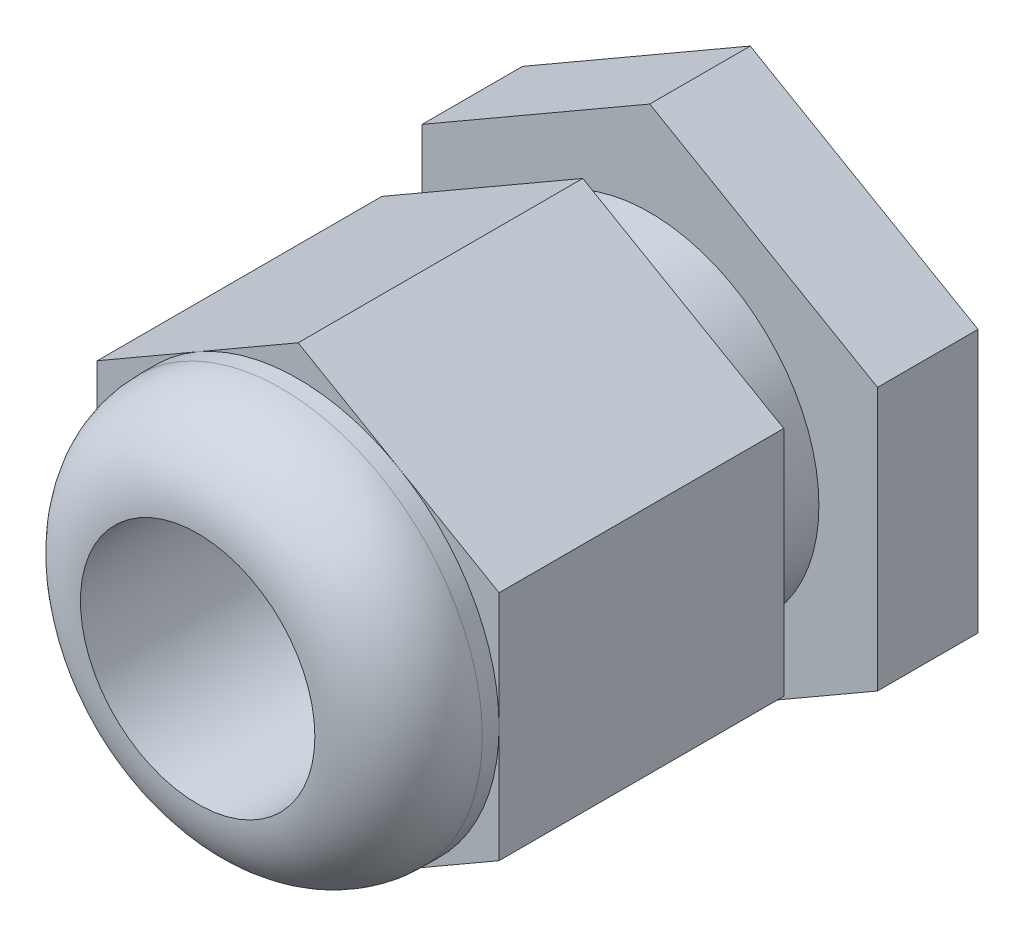
ISO-10303-21;
HEADER;
FILE_DESCRIPTION(('STEP AP214'),'2;1');
FILE_NAME('part.step','',(''),(''),'','','');
FILE_SCHEMA(('AUTOMOTIVE_DESIGN { 1 0 10303 214 1 1 1 1 }'));
ENDSEC;
DATA;
#1=APPLICATION_CONTEXT('core data for automotive mechanical design processes');
#2=APPLICATION_PROTOCOL_DEFINITION('international standard','automotive_design',2000,#1);
#3=PRODUCT_CONTEXT('',#1,'mechanical');
#4=PRODUCT('Part','Part','',(#3));
#5=PRODUCT_RELATED_PRODUCT_CATEGORY('part','',(#4));
#6=PRODUCT_DEFINITION_FORMATION('','',#4);
#7=PRODUCT_DEFINITION_CONTEXT('part definition',#1,'design');
#8=PRODUCT_DEFINITION('design','',#6,#7);
#9=PRODUCT_DEFINITION_SHAPE('','',#8);
#10=(LENGTH_UNIT() NAMED_UNIT(*) SI_UNIT(.MILLI.,.METRE.));
#11=(NAMED_UNIT(*) PLANE_ANGLE_UNIT() SI_UNIT($,.RADIAN.));
#12=(NAMED_UNIT(*) SI_UNIT($,.STERADIAN.) SOLID_ANGLE_UNIT());
#13=UNCERTAINTY_MEASURE_WITH_UNIT(LENGTH_MEASURE(1.E-05),#10,'distance_accuracy_value','');
#14=(GEOMETRIC_REPRESENTATION_CONTEXT(3) GLOBAL_UNCERTAINTY_ASSIGNED_CONTEXT((#13)) GLOBAL_UNIT_ASSIGNED_CONTEXT((#10,
#11,#12)) REPRESENTATION_CONTEXT('',''));
#15=CARTESIAN_POINT('',(0.,0.,0.));
#16=DIRECTION('',(0.,0.,1.));
#17=DIRECTION('',(1.,0.,0.));
#18=AXIS2_PLACEMENT_3D('',#15,#16,#17);
#19=CARTESIAN_POINT('',(0.,0.,-18.5));
#20=DIRECTION('',(0.,0.,-1.));
#21=DIRECTION('',(-1.,0.,0.));
#22=AXIS2_PLACEMENT_3D('',#19,#20,#21);
#23=PLANE('',#22);
#24=DIRECTION('',(0.866025403784439,0.5,0.));
#25=VECTOR('',#24,1.);
#26=CARTESIAN_POINT('',(-13.6,7.85196366097892,-18.5));
#27=LINE('',#26,#25);
#28=CARTESIAN_POINT('',(-13.6,7.85196366097892,-18.5));
#29=VERTEX_POINT('',#28);
#30=CARTESIAN_POINT('',(0.,15.7039273219578,-18.5));
#31=VERTEX_POINT('',#30);
#32=EDGE_CURVE('E184',#29,#31,#27,.T.);
#33=ORIENTED_EDGE('',*,*,#32,.T.);
#34=DIRECTION('',(0.866025403784439,-0.5,0.));
#35=VECTOR('',#34,1.);
#36=CARTESIAN_POINT('',(0.,15.7039273219578,-18.5));
#37=LINE('',#36,#35);
#38=CARTESIAN_POINT('',(13.6,7.85196366097892,-18.5));
#39=VERTEX_POINT('',#38);
#40=EDGE_CURVE('E145',#31,#39,#37,.T.);
#41=ORIENTED_EDGE('',*,*,#40,.T.);
#42=DIRECTION('',(0.,-1.,0.));
#43=VECTOR('',#42,1.);
#44=CARTESIAN_POINT('',(13.6,7.85196366097892,-18.5));
#45=LINE('',#44,#43);
#46=CARTESIAN_POINT('',(13.6,-7.85196366097891,-18.5));
#47=VERTEX_POINT('',#46);
#48=EDGE_CURVE('E188',#39,#47,#45,.T.);
#49=ORIENTED_EDGE('',*,*,#48,.T.);
#50=DIRECTION('',(-0.866025403784439,-0.5,0.));
#51=VECTOR('',#50,1.);
#52=CARTESIAN_POINT('',(13.6,-7.85196366097891,-18.5));
#53=LINE('',#52,#51);
#54=CARTESIAN_POINT('',(0.,-15.7039273219578,-18.5));
#55=VERTEX_POINT('',#54);
#56=EDGE_CURVE('E191',#47,#55,#53,.T.);
#57=ORIENTED_EDGE('',*,*,#56,.T.);
#58=DIRECTION('',(-0.866025403784439,0.5,0.));
#59=VECTOR('',#58,1.);
#60=CARTESIAN_POINT('',(0.,-15.7039273219578,-18.5));
#61=LINE('',#60,#59);
#62=CARTESIAN_POINT('',(-13.6,-7.85196366097891,-18.5));
#63=VERTEX_POINT('',#62);
#64=EDGE_CURVE('E170',#55,#63,#61,.T.);
#65=ORIENTED_EDGE('',*,*,#64,.T.);
#66=DIRECTION('',(0.,1.,0.));
#67=VECTOR('',#66,1.);
#68=CARTESIAN_POINT('',(-13.6,-7.85196366097891,-18.5));
#69=LINE('',#68,#67);
#70=EDGE_CURVE('E167',#63,#29,#69,.T.);
#71=ORIENTED_EDGE('',*,*,#70,.T.);
#72=EDGE_LOOP('',(#33,#41,#49,#57,#65,#71));
#73=FACE_BOUND('',#72,.T.);
#74=CARTESIAN_POINT('',(0.,0.,-18.5));
#75=DIRECTION('',(0.,0.,-1.));
#76=DIRECTION('',(-1.,0.,0.));
#77=AXIS2_PLACEMENT_3D('',#74,#75,#76);
#78=CIRCLE('',#77,10.1);
#79=CARTESIAN_POINT('',(-10.1,0.,-18.5));
#80=VERTEX_POINT('',#79);
#81=EDGE_CURVE('E173',#80,#80,#78,.T.);
#82=ORIENTED_EDGE('',*,*,#81,.F.);
#83=EDGE_LOOP('',(#82));
#84=FACE_BOUND('',#83,.T.);
#85=ADVANCED_FACE('F32',(#73,#84),#23,.T.);
#86=CARTESIAN_POINT('',(0.,0.,-18.5));
#87=DIRECTION('',(0.,0.,1.));
#88=DIRECTION('',(1.,0.,0.));
#89=AXIS2_PLACEMENT_3D('',#86,#87,#88);
#90=CYLINDRICAL_SURFACE('',#89,10.1);
#91=CARTESIAN_POINT('',(0.,0.,-8.5));
#92=DIRECTION('',(0.,0.,1.));
#93=DIRECTION('',(1.,0.,0.));
#94=AXIS2_PLACEMENT_3D('',#91,#92,#93);
#95=CIRCLE('',#94,10.1);
#96=CARTESIAN_POINT('',(10.1,0.,-8.5));
#97=VERTEX_POINT('',#96);
#98=EDGE_CURVE('E40',#97,#97,#95,.F.);
#99=ORIENTED_EDGE('',*,*,#98,.T.);
#100=EDGE_LOOP('',(#99));
#101=FACE_BOUND('',#100,.T.);
#102=CARTESIAN_POINT('',(0.,0.,-12.5));
#103=DIRECTION('',(0.,0.,-1.));
#104=DIRECTION('',(-1.,0.,0.));
#105=AXIS2_PLACEMENT_3D('',#102,#103,#104);
#106=CIRCLE('',#105,10.1);
#107=CARTESIAN_POINT('',(-10.1,0.,-12.5));
#108=VERTEX_POINT('',#107);
#109=EDGE_CURVE('E11',#108,#108,#106,.T.);
#110=ORIENTED_EDGE('',*,*,#109,.F.);
#111=EDGE_LOOP('',(#110));
#112=FACE_BOUND('',#111,.T.);
#113=ADVANCED_FACE('F266',(#101,#112),#90,.T.);
#114=CARTESIAN_POINT('',(0.,0.,-8.5));
#115=DIRECTION('',(0.,0.,1.));
#116=DIRECTION('',(1.,0.,0.));
#117=AXIS2_PLACEMENT_3D('',#114,#115,#116);
#118=PLANE('',#117);
#119=DIRECTION('',(-0.866025403784439,0.5,0.));
#120=VECTOR('',#119,1.);
#121=CARTESIAN_POINT('',(12.,6.92820323027552,-8.5));
#122=LINE('',#121,#120);
#123=CARTESIAN_POINT('',(12.,6.92820323027552,-8.5));
#124=VERTEX_POINT('',#123);
#125=CARTESIAN_POINT('',(0.,13.856406460551,-8.5));
#126=VERTEX_POINT('',#125);
#127=EDGE_CURVE('E207',#124,#126,#122,.T.);
#128=ORIENTED_EDGE('',*,*,#127,.F.);
#129=DIRECTION('',(0.,1.,0.));
#130=VECTOR('',#129,1.);
#131=CARTESIAN_POINT('',(12.,-6.92820323027551,-8.5));
#132=LINE('',#131,#130);
#133=CARTESIAN_POINT('',(12.,-6.92820323027551,-8.5));
#134=VERTEX_POINT('',#133);
#135=EDGE_CURVE('E242',#134,#124,#132,.T.);
#136=ORIENTED_EDGE('',*,*,#135,.F.);
#137=DIRECTION('',(0.866025403784439,0.5,0.));
#138=VECTOR('',#137,1.);
#139=CARTESIAN_POINT('',(0.,-13.856406460551,-8.5));
#140=LINE('',#139,#138);
#141=CARTESIAN_POINT('',(0.,-13.856406460551,-8.5));
#142=VERTEX_POINT('',#141);
#143=EDGE_CURVE('E240',#142,#134,#140,.T.);
#144=ORIENTED_EDGE('',*,*,#143,.F.);
#145=DIRECTION('',(0.866025403784438,-0.5,0.));
#146=VECTOR('',#145,1.);
#147=CARTESIAN_POINT('',(-12.,-6.92820323027551,-8.5));
#148=LINE('',#147,#146);
#149=CARTESIAN_POINT('',(-12.,-6.92820323027551,-8.5));
#150=VERTEX_POINT('',#149);
#151=EDGE_CURVE('E238',#150,#142,#148,.T.);
#152=ORIENTED_EDGE('',*,*,#151,.F.);
#153=DIRECTION('',(0.,-1.,0.));
#154=VECTOR('',#153,1.);
#155=CARTESIAN_POINT('',(-12.,6.92820323027551,-8.5));
#156=LINE('',#155,#154);
#157=CARTESIAN_POINT('',(-12.,6.92820323027551,-8.5));
#158=VERTEX_POINT('',#157);
#159=EDGE_CURVE('E236',#158,#150,#156,.T.);
#160=ORIENTED_EDGE('',*,*,#159,.F.);
#161=DIRECTION('',(-0.866025403784439,-0.5,0.));
#162=VECTOR('',#161,1.);
#163=CARTESIAN_POINT('',(0.,13.856406460551,-8.5));
#164=LINE('',#163,#162);
#165=EDGE_CURVE('E234',#126,#158,#164,.T.);
#166=ORIENTED_EDGE('',*,*,#165,.F.);
#167=EDGE_LOOP('',(#128,#136,#144,#152,#160,#166));
#168=FACE_BOUND('',#167,.T.);
#169=ORIENTED_EDGE('',*,*,#98,.F.);
#170=EDGE_LOOP('',(#169));
#171=FACE_BOUND('',#170,.T.);
#172=ADVANCED_FACE('F269',(#168,#171),#118,.F.);
#173=CARTESIAN_POINT('',(0.,0.,8.5));
#174=DIRECTION('',(0.,0.,1.));
#175=DIRECTION('',(1.,0.,0.));
#176=AXIS2_PLACEMENT_3D('',#173,#174,#175);
#177=PLANE('',#176);
#178=CARTESIAN_POINT('',(0.,0.,8.5));
#179=DIRECTION('',(0.,0.,1.));
#180=DIRECTION('',(1.,0.,0.));
#181=AXIS2_PLACEMENT_3D('',#178,#179,#180);
#182=CIRCLE('',#181,12.);
#183=CARTESIAN_POINT('',(12.,0.,8.5));
#184=VERTEX_POINT('',#183);
#185=CARTESIAN_POINT('',(6.,10.3923048454133,8.5));
#186=VERTEX_POINT('',#185);
#187=EDGE_CURVE('E197',#184,#186,#182,.T.);
#188=ORIENTED_EDGE('',*,*,#187,.F.);
#189=DIRECTION('',(0.,1.,0.));
#190=VECTOR('',#189,1.);
#191=CARTESIAN_POINT('',(12.,-6.92820323027551,8.5));
#192=LINE('',#191,#190);
#193=CARTESIAN_POINT('',(12.,6.92820323027552,8.5));
#194=VERTEX_POINT('',#193);
#195=EDGE_CURVE('E228',#184,#194,#192,.T.);
#196=ORIENTED_EDGE('',*,*,#195,.T.);
#197=DIRECTION('',(-0.866025403784439,0.5,0.));
#198=VECTOR('',#197,1.);
#199=CARTESIAN_POINT('',(12.,6.92820323027552,8.5));
#200=LINE('',#199,#198);
#201=EDGE_CURVE('E209',#194,#186,#200,.T.);
#202=ORIENTED_EDGE('',*,*,#201,.T.);
#203=EDGE_LOOP('',(#188,#196,#202));
#204=FACE_BOUND('',#203,.T.);
#205=ADVANCED_FACE('F271',(#204),#177,.T.);
#206=CARTESIAN_POINT('',(-6.,10.3923048454133,8.5));
#207=VERTEX_POINT('',#206);
#208=EDGE_CURVE('E208',#186,#207,#182,.T.);
#209=ORIENTED_EDGE('',*,*,#208,.F.);
#210=CARTESIAN_POINT('',(0.,13.856406460551,8.5));
#211=VERTEX_POINT('',#210);
#212=EDGE_CURVE('E213',#186,#211,#200,.T.);
#213=ORIENTED_EDGE('',*,*,#212,.T.);
#214=DIRECTION('',(-0.866025403784439,-0.5,0.));
#215=VECTOR('',#214,1.);
#216=CARTESIAN_POINT('',(0.,13.856406460551,8.5));
#217=LINE('',#216,#215);
#218=EDGE_CURVE('E214',#211,#207,#217,.T.);
#219=ORIENTED_EDGE('',*,*,#218,.T.);
#220=EDGE_LOOP('',(#209,#213,#219));
#221=FACE_BOUND('',#220,.T.);
#222=ADVANCED_FACE('F278',(#221),#177,.T.);
#223=CARTESIAN_POINT('',(-12.,0.,8.5));
#224=VERTEX_POINT('',#223);
#225=EDGE_CURVE('E327',#207,#224,#182,.T.);
#226=ORIENTED_EDGE('',*,*,#225,.F.);
#227=CARTESIAN_POINT('',(-12.,6.92820323027551,8.5));
#228=VERTEX_POINT('',#227);
#229=EDGE_CURVE('E212',#207,#228,#217,.T.);
#230=ORIENTED_EDGE('',*,*,#229,.T.);
#231=DIRECTION('',(0.,-1.,0.));
#232=VECTOR('',#231,1.);
#233=CARTESIAN_POINT('',(-12.,6.92820323027551,8.5));
#234=LINE('',#233,#232);
#235=EDGE_CURVE('E218',#228,#224,#234,.T.);
#236=ORIENTED_EDGE('',*,*,#235,.T.);
#237=EDGE_LOOP('',(#226,#230,#236));
#238=FACE_BOUND('',#237,.T.);
#239=ADVANCED_FACE('F314',(#238),#177,.T.);
#240=CARTESIAN_POINT('',(-6.00000000000001,-10.3923048454133,8.5));
#241=VERTEX_POINT('',#240);
#242=EDGE_CURVE('E321',#224,#241,#182,.T.);
#243=ORIENTED_EDGE('',*,*,#242,.F.);
#244=CARTESIAN_POINT('',(-12.,-6.92820323027551,8.5));
#245=VERTEX_POINT('',#244);
#246=EDGE_CURVE('E217',#224,#245,#234,.T.);
#247=ORIENTED_EDGE('',*,*,#246,.T.);
#248=DIRECTION('',(0.866025403784438,-0.5,0.));
#249=VECTOR('',#248,1.);
#250=CARTESIAN_POINT('',(-12.,-6.92820323027551,8.5));
#251=LINE('',#250,#249);
#252=EDGE_CURVE('E222',#245,#241,#251,.T.);
#253=ORIENTED_EDGE('',*,*,#252,.T.);
#254=EDGE_LOOP('',(#243,#247,#253));
#255=FACE_BOUND('',#254,.T.);
#256=ADVANCED_FACE('F307',(#255),#177,.T.);
#257=CARTESIAN_POINT('',(6.,-10.3923048454133,8.5));
#258=VERTEX_POINT('',#257);
#259=EDGE_CURVE('E55',#241,#258,#182,.T.);
#260=ORIENTED_EDGE('',*,*,#259,.F.);
#261=CARTESIAN_POINT('',(0.,-13.856406460551,8.5));
#262=VERTEX_POINT('',#261);
#263=EDGE_CURVE('E221',#241,#262,#251,.T.);
#264=ORIENTED_EDGE('',*,*,#263,.T.);
#265=DIRECTION('',(0.866025403784439,0.5,0.));
#266=VECTOR('',#265,1.);
#267=CARTESIAN_POINT('',(0.,-13.856406460551,8.5));
#268=LINE('',#267,#266);
#269=EDGE_CURVE('E226',#262,#258,#268,.T.);
#270=ORIENTED_EDGE('',*,*,#269,.T.);
#271=EDGE_LOOP('',(#260,#264,#270));
#272=FACE_BOUND('',#271,.T.);
#273=ADVANCED_FACE('F299',(#272),#177,.T.);
#274=CARTESIAN_POINT('',(12.,6.92820323027552,8.5));
#275=DIRECTION('',(-0.5,-0.866025403784439,0.));
#276=DIRECTION('',(0.866025403784439,-0.5,0.));
#277=AXIS2_PLACEMENT_3D('',#274,#275,#276);
#278=PLANE('',#277);
#279=ORIENTED_EDGE('',*,*,#127,.T.);
#280=DIRECTION('',(0.,0.,-1.));
#281=VECTOR('',#280,1.);
#282=CARTESIAN_POINT('',(0.,13.856406460551,8.5));
#283=LINE('',#282,#281);
#284=EDGE_CURVE('E258',#211,#126,#283,.T.);
#285=ORIENTED_EDGE('',*,*,#284,.F.);
#286=ORIENTED_EDGE('',*,*,#212,.F.);
#287=ORIENTED_EDGE('',*,*,#201,.F.);
#288=DIRECTION('',(0.,0.,-1.));
#289=VECTOR('',#288,1.);
#290=CARTESIAN_POINT('',(12.,6.92820323027552,8.5));
#291=LINE('',#290,#289);
#292=EDGE_CURVE('E231',#194,#124,#291,.T.);
#293=ORIENTED_EDGE('',*,*,#292,.T.);
#294=EDGE_LOOP('',(#279,#285,#286,#287,#293));
#295=FACE_BOUND('',#294,.T.);
#296=ADVANCED_FACE('F306',(#295),#278,.F.);
#297=CARTESIAN_POINT('',(0.,13.856406460551,8.5));
#298=DIRECTION('',(0.5,-0.866025403784439,0.));
#299=DIRECTION('',(0.866025403784439,0.5,0.));
#300=AXIS2_PLACEMENT_3D('',#297,#298,#299);
#301=PLANE('',#300);
#302=ORIENTED_EDGE('',*,*,#165,.T.);
#303=DIRECTION('',(0.,0.,-1.));
#304=VECTOR('',#303,1.);
#305=CARTESIAN_POINT('',(-12.,6.92820323027551,8.5));
#306=LINE('',#305,#304);
#307=EDGE_CURVE('E255',#228,#158,#306,.T.);
#308=ORIENTED_EDGE('',*,*,#307,.F.);
#309=ORIENTED_EDGE('',*,*,#229,.F.);
#310=ORIENTED_EDGE('',*,*,#218,.F.);
#311=ORIENTED_EDGE('',*,*,#284,.T.);
#312=EDGE_LOOP('',(#302,#308,#309,#310,#311));
#313=FACE_BOUND('',#312,.T.);
#314=ADVANCED_FACE('F312',(#313),#301,.F.);
#315=CARTESIAN_POINT('',(-12.,6.92820323027551,8.5));
#316=DIRECTION('',(1.,0.,0.));
#317=DIRECTION('',(0.,1.,0.));
#318=AXIS2_PLACEMENT_3D('',#315,#316,#317);
#319=PLANE('',#318);
#320=ORIENTED_EDGE('',*,*,#159,.T.);
#321=DIRECTION('',(0.,0.,-1.));
#322=VECTOR('',#321,1.);
#323=CARTESIAN_POINT('',(-12.,-6.92820323027551,8.5));
#324=LINE('',#323,#322);
#325=EDGE_CURVE('E252',#245,#150,#324,.T.);
#326=ORIENTED_EDGE('',*,*,#325,.F.);
#327=ORIENTED_EDGE('',*,*,#246,.F.);
#328=ORIENTED_EDGE('',*,*,#235,.F.);
#329=ORIENTED_EDGE('',*,*,#307,.T.);
#330=EDGE_LOOP('',(#320,#326,#327,#328,#329));
#331=FACE_BOUND('',#330,.T.);
#332=ADVANCED_FACE('F330',(#331),#319,.F.);
#333=CARTESIAN_POINT('',(-12.,-6.92820323027551,8.5));
#334=DIRECTION('',(0.5,0.866025403784438,0.));
#335=DIRECTION('',(-0.866025403784438,0.5,0.));
#336=AXIS2_PLACEMENT_3D('',#333,#334,#335);
#337=PLANE('',#336);
#338=ORIENTED_EDGE('',*,*,#151,.T.);
#339=DIRECTION('',(0.,0.,-1.));
#340=VECTOR('',#339,1.);
#341=CARTESIAN_POINT('',(0.,-13.856406460551,8.5));
#342=LINE('',#341,#340);
#343=EDGE_CURVE('E249',#262,#142,#342,.T.);
#344=ORIENTED_EDGE('',*,*,#343,.F.);
#345=ORIENTED_EDGE('',*,*,#263,.F.);
#346=ORIENTED_EDGE('',*,*,#252,.F.);
#347=ORIENTED_EDGE('',*,*,#325,.T.);
#348=EDGE_LOOP('',(#338,#344,#345,#346,#347));
#349=FACE_BOUND('',#348,.T.);
#350=ADVANCED_FACE('F349',(#349),#337,.F.);
#351=CARTESIAN_POINT('',(0.,-13.856406460551,8.5));
#352=DIRECTION('',(-0.5,0.866025403784439,0.));
#353=DIRECTION('',(-0.866025403784439,-0.5,0.));
#354=AXIS2_PLACEMENT_3D('',#351,#352,#353);
#355=PLANE('',#354);
#356=ORIENTED_EDGE('',*,*,#143,.T.);
#357=DIRECTION('',(0.,0.,-1.));
#358=VECTOR('',#357,1.);
#359=CARTESIAN_POINT('',(12.,-6.92820323027551,8.5));
#360=LINE('',#359,#358);
#361=CARTESIAN_POINT('',(12.,-6.92820323027551,8.5));
#362=VERTEX_POINT('',#361);
#363=EDGE_CURVE('E246',#362,#134,#360,.T.);
#364=ORIENTED_EDGE('',*,*,#363,.F.);
#365=EDGE_CURVE('E225',#258,#362,#268,.T.);
#366=ORIENTED_EDGE('',*,*,#365,.F.);
#367=ORIENTED_EDGE('',*,*,#269,.F.);
#368=ORIENTED_EDGE('',*,*,#343,.T.);
#369=EDGE_LOOP('',(#356,#364,#366,#367,#368));
#370=FACE_BOUND('',#369,.T.);
#371=ADVANCED_FACE('F303',(#370),#355,.F.);
#372=CARTESIAN_POINT('',(12.,-6.92820323027551,8.5));
#373=DIRECTION('',(-1.,0.,0.));
#374=DIRECTION('',(0.,0.,1.));
#375=AXIS2_PLACEMENT_3D('',#372,#373,#374);
#376=PLANE('',#375);
#377=ORIENTED_EDGE('',*,*,#135,.T.);
#378=ORIENTED_EDGE('',*,*,#292,.F.);
#379=ORIENTED_EDGE('',*,*,#195,.F.);
#380=EDGE_CURVE('E229',#362,#184,#192,.T.);
#381=ORIENTED_EDGE('',*,*,#380,.F.);
#382=ORIENTED_EDGE('',*,*,#363,.T.);
#383=EDGE_LOOP('',(#377,#378,#379,#381,#382));
#384=FACE_BOUND('',#383,.T.);
#385=ADVANCED_FACE('F298',(#384),#376,.F.);
#386=EDGE_CURVE('E47',#258,#184,#182,.T.);
#387=ORIENTED_EDGE('',*,*,#386,.F.);
#388=ORIENTED_EDGE('',*,*,#365,.T.);
#389=ORIENTED_EDGE('',*,*,#380,.T.);
#390=EDGE_LOOP('',(#387,#388,#389));
#391=FACE_BOUND('',#390,.T.);
#392=ADVANCED_FACE('F281',(#391),#177,.T.);
#393=CARTESIAN_POINT('',(0.,0.,14.5));
#394=DIRECTION('',(0.,0.,-1.));
#395=DIRECTION('',(-1.,0.,0.));
#396=AXIS2_PLACEMENT_3D('',#393,#394,#395);
#397=CYLINDRICAL_SURFACE('',#396,12.);
#398=CARTESIAN_POINT('',(0.,0.,9.5));
#399=DIRECTION('',(0.,0.,1.));
#400=DIRECTION('',(1.,0.,0.));
#401=AXIS2_PLACEMENT_3D('',#398,#399,#400);
#402=CIRCLE('',#401,12.);
#403=CARTESIAN_POINT('',(12.,0.,9.5));
#404=VERTEX_POINT('',#403);
#405=EDGE_CURVE('E261',#404,#404,#402,.F.);
#406=ORIENTED_EDGE('',*,*,#405,.T.);
#407=EDGE_LOOP('',(#406));
#408=FACE_BOUND('',#407,.T.);
#409=ORIENTED_EDGE('',*,*,#187,.T.);
#410=ORIENTED_EDGE('',*,*,#208,.T.);
#411=ORIENTED_EDGE('',*,*,#225,.T.);
#412=ORIENTED_EDGE('',*,*,#242,.T.);
#413=ORIENTED_EDGE('',*,*,#259,.T.);
#414=ORIENTED_EDGE('',*,*,#386,.T.);
#415=EDGE_LOOP('',(#409,#410,#411,#412,#413,#414));
#416=FACE_BOUND('',#415,.T.);
#417=ADVANCED_FACE('F294',(#408,#416),#397,.T.);
#418=CARTESIAN_POINT('',(0.,0.,9.5));
#419=DIRECTION('',(0.,0.,1.));
#420=DIRECTION('',(1.,0.,0.));
#421=AXIS2_PLACEMENT_3D('',#418,#419,#420);
#422=TOROIDAL_SURFACE('',#421,7.00000000000001,5.);
#423=ORIENTED_EDGE('',*,*,#405,.F.);
#424=EDGE_LOOP('',(#423));
#425=FACE_BOUND('',#424,.T.);
#426=CARTESIAN_POINT('',(0.,0.,14.5));
#427=DIRECTION('',(0.,0.,1.));
#428=DIRECTION('',(1.,0.,0.));
#429=AXIS2_PLACEMENT_3D('',#426,#427,#428);
#430=CIRCLE('',#429,7.00000000000001);
#431=CARTESIAN_POINT('',(7.00000000000001,0.,14.5));
#432=VERTEX_POINT('',#431);
#433=EDGE_CURVE('E523',#432,#432,#430,.T.);
#434=ORIENTED_EDGE('',*,*,#433,.F.);
#435=EDGE_LOOP('',(#434));
#436=FACE_BOUND('',#435,.T.);
#437=ADVANCED_FACE('F34',(#425,#436),#422,.T.);
#438=CARTESIAN_POINT('',(0.,0.,-12.5));
#439=DIRECTION('',(0.,0.,-1.));
#440=DIRECTION('',(-1.,0.,0.));
#441=AXIS2_PLACEMENT_3D('',#438,#439,#440);
#442=PLANE('',#441);
#443=DIRECTION('',(0.866025403784439,0.5,0.));
#444=VECTOR('',#443,1.);
#445=CARTESIAN_POINT('',(-13.6,7.85196366097892,-12.5));
#446=LINE('',#445,#444);
#447=CARTESIAN_POINT('',(-13.6,7.85196366097892,-12.5));
#448=VERTEX_POINT('',#447);
#449=CARTESIAN_POINT('',(0.,15.7039273219578,-12.5));
#450=VERTEX_POINT('',#449);
#451=EDGE_CURVE('E159',#448,#450,#446,.T.);
#452=ORIENTED_EDGE('',*,*,#451,.F.);
#453=DIRECTION('',(0.,1.,0.));
#454=VECTOR('',#453,1.);
#455=CARTESIAN_POINT('',(-13.6,-7.85196366097891,-12.5));
#456=LINE('',#455,#454);
#457=CARTESIAN_POINT('',(-13.6,-7.85196366097891,-12.5));
#458=VERTEX_POINT('',#457);
#459=EDGE_CURVE('E151',#458,#448,#456,.T.);
#460=ORIENTED_EDGE('',*,*,#459,.F.);
#461=DIRECTION('',(-0.866025403784439,0.5,0.));
#462=VECTOR('',#461,1.);
#463=CARTESIAN_POINT('',(0.,-15.7039273219578,-12.5));
#464=LINE('',#463,#462);
#465=CARTESIAN_POINT('',(0.,-15.7039273219578,-12.5));
#466=VERTEX_POINT('',#465);
#467=EDGE_CURVE('E180',#466,#458,#464,.T.);
#468=ORIENTED_EDGE('',*,*,#467,.F.);
#469=DIRECTION('',(-0.866025403784439,-0.5,0.));
#470=VECTOR('',#469,1.);
#471=CARTESIAN_POINT('',(13.6,-7.85196366097891,-12.5));
#472=LINE('',#471,#470);
#473=CARTESIAN_POINT('',(13.6,-7.85196366097891,-12.5));
#474=VERTEX_POINT('',#473);
#475=EDGE_CURVE('E177',#474,#466,#472,.T.);
#476=ORIENTED_EDGE('',*,*,#475,.F.);
#477=DIRECTION('',(0.,-1.,0.));
#478=VECTOR('',#477,1.);
#479=CARTESIAN_POINT('',(13.6,7.85196366097892,-12.5));
#480=LINE('',#479,#478);
#481=CARTESIAN_POINT('',(13.6,7.85196366097892,-12.5));
#482=VERTEX_POINT('',#481);
#483=EDGE_CURVE('E163',#482,#474,#480,.T.);
#484=ORIENTED_EDGE('',*,*,#483,.F.);
#485=DIRECTION('',(0.866025403784439,-0.5,0.));
#486=VECTOR('',#485,1.);
#487=CARTESIAN_POINT('',(0.,15.7039273219578,-12.5));
#488=LINE('',#487,#486);
#489=EDGE_CURVE('E143',#450,#482,#488,.T.);
#490=ORIENTED_EDGE('',*,*,#489,.F.);
#491=EDGE_LOOP('',(#452,#460,#468,#476,#484,#490));
#492=FACE_BOUND('',#491,.T.);
#493=ORIENTED_EDGE('',*,*,#109,.T.);
#494=EDGE_LOOP('',(#493));
#495=FACE_BOUND('',#494,.T.);
#496=ADVANCED_FACE('F156',(#492,#495),#442,.F.);
#497=CARTESIAN_POINT('',(-13.6,7.85196366097892,-12.5));
#498=DIRECTION('',(-0.5,0.866025403784439,0.));
#499=DIRECTION('',(-0.866025403784439,-0.5,0.));
#500=AXIS2_PLACEMENT_3D('',#497,#498,#499);
#501=PLANE('',#500);
#502=ORIENTED_EDGE('',*,*,#32,.F.);
#503=DIRECTION('',(0.,0.,-1.));
#504=VECTOR('',#503,1.);
#505=CARTESIAN_POINT('',(-13.6,7.85196366097892,-12.5));
#506=LINE('',#505,#504);
#507=EDGE_CURVE('E166',#448,#29,#506,.T.);
#508=ORIENTED_EDGE('',*,*,#507,.F.);
#509=ORIENTED_EDGE('',*,*,#451,.T.);
#510=DIRECTION('',(0.,0.,-1.));
#511=VECTOR('',#510,1.);
#512=CARTESIAN_POINT('',(0.,15.7039273219578,-12.5));
#513=LINE('',#512,#511);
#514=EDGE_CURVE('E140',#450,#31,#513,.T.);
#515=ORIENTED_EDGE('',*,*,#514,.T.);
#516=EDGE_LOOP('',(#502,#508,#509,#515));
#517=FACE_BOUND('',#516,.T.);
#518=ADVANCED_FACE('F165',(#517),#501,.T.);
#519=CARTESIAN_POINT('',(-13.6,-7.85196366097891,-12.5));
#520=DIRECTION('',(-1.,0.,0.));
#521=DIRECTION('',(0.,0.,1.));
#522=AXIS2_PLACEMENT_3D('',#519,#520,#521);
#523=PLANE('',#522);
#524=ORIENTED_EDGE('',*,*,#70,.F.);
#525=DIRECTION('',(0.,0.,-1.));
#526=VECTOR('',#525,1.);
#527=CARTESIAN_POINT('',(-13.6,-7.85196366097891,-12.5));
#528=LINE('',#527,#526);
#529=EDGE_CURVE('E198',#458,#63,#528,.T.);
#530=ORIENTED_EDGE('',*,*,#529,.F.);
#531=ORIENTED_EDGE('',*,*,#459,.T.);
#532=ORIENTED_EDGE('',*,*,#507,.T.);
#533=EDGE_LOOP('',(#524,#530,#531,#532));
#534=FACE_BOUND('',#533,.T.);
#535=ADVANCED_FACE('F433',(#534),#523,.T.);
#536=CARTESIAN_POINT('',(0.,-15.7039273219578,-12.5));
#537=DIRECTION('',(-0.5,-0.866025403784438,0.));
#538=DIRECTION('',(0.866025403784439,-0.5,0.));
#539=AXIS2_PLACEMENT_3D('',#536,#537,#538);
#540=PLANE('',#539);
#541=ORIENTED_EDGE('',*,*,#64,.F.);
#542=DIRECTION('',(0.,0.,-1.));
#543=VECTOR('',#542,1.);
#544=CARTESIAN_POINT('',(0.,-15.7039273219578,-12.5));
#545=LINE('',#544,#543);
#546=EDGE_CURVE('E200',#466,#55,#545,.T.);
#547=ORIENTED_EDGE('',*,*,#546,.F.);
#548=ORIENTED_EDGE('',*,*,#467,.T.);
#549=ORIENTED_EDGE('',*,*,#529,.T.);
#550=EDGE_LOOP('',(#541,#547,#548,#549));
#551=FACE_BOUND('',#550,.T.);
#552=ADVANCED_FACE('F441',(#551),#540,.T.);
#553=CARTESIAN_POINT('',(13.6,-7.85196366097891,-12.5));
#554=DIRECTION('',(0.5,-0.866025403784438,0.));
#555=DIRECTION('',(0.866025403784439,0.5,0.));
#556=AXIS2_PLACEMENT_3D('',#553,#554,#555);
#557=PLANE('',#556);
#558=ORIENTED_EDGE('',*,*,#56,.F.);
#559=DIRECTION('',(0.,0.,-1.));
#560=VECTOR('',#559,1.);
#561=CARTESIAN_POINT('',(13.6,-7.85196366097891,-12.5));
#562=LINE('',#561,#560);
#563=EDGE_CURVE('E202',#474,#47,#562,.T.);
#564=ORIENTED_EDGE('',*,*,#563,.F.);
#565=ORIENTED_EDGE('',*,*,#475,.T.);
#566=ORIENTED_EDGE('',*,*,#546,.T.);
#567=EDGE_LOOP('',(#558,#564,#565,#566));
#568=FACE_BOUND('',#567,.T.);
#569=ADVANCED_FACE('F451',(#568),#557,.T.);
#570=CARTESIAN_POINT('',(13.6,7.85196366097892,-12.5));
#571=DIRECTION('',(1.,0.,0.));
#572=DIRECTION('',(0.,1.,0.));
#573=AXIS2_PLACEMENT_3D('',#570,#571,#572);
#574=PLANE('',#573);
#575=ORIENTED_EDGE('',*,*,#48,.F.);
#576=DIRECTION('',(0.,0.,-1.));
#577=VECTOR('',#576,1.);
#578=CARTESIAN_POINT('',(13.6,7.85196366097892,-12.5));
#579=LINE('',#578,#577);
#580=EDGE_CURVE('E150',#482,#39,#579,.T.);
#581=ORIENTED_EDGE('',*,*,#580,.F.);
#582=ORIENTED_EDGE('',*,*,#483,.T.);
#583=ORIENTED_EDGE('',*,*,#563,.T.);
#584=EDGE_LOOP('',(#575,#581,#582,#583));
#585=FACE_BOUND('',#584,.T.);
#586=ADVANCED_FACE('F461',(#585),#574,.T.);
#587=CARTESIAN_POINT('',(0.,15.7039273219578,-12.5));
#588=DIRECTION('',(0.5,0.866025403784439,0.));
#589=DIRECTION('',(-0.866025403784439,0.5,0.));
#590=AXIS2_PLACEMENT_3D('',#587,#588,#589);
#591=PLANE('',#590);
#592=ORIENTED_EDGE('',*,*,#40,.F.);
#593=ORIENTED_EDGE('',*,*,#514,.F.);
#594=ORIENTED_EDGE('',*,*,#489,.T.);
#595=ORIENTED_EDGE('',*,*,#580,.T.);
#596=EDGE_LOOP('',(#592,#593,#594,#595));
#597=FACE_BOUND('',#596,.T.);
#598=ADVANCED_FACE('F142',(#597),#591,.T.);
#599=CARTESIAN_POINT('',(0.,0.,-19.5));
#600=DIRECTION('',(0.,0.,1.));
#601=DIRECTION('',(1.,0.,0.));
#602=AXIS2_PLACEMENT_3D('',#599,#600,#601);
#603=CYLINDRICAL_SURFACE('',#602,10.1);
#604=CARTESIAN_POINT('',(0.,0.,-19.5));
#605=DIRECTION('',(0.,0.,-1.));
#606=DIRECTION('',(-1.,0.,0.));
#607=AXIS2_PLACEMENT_3D('',#604,#605,#606);
#608=CIRCLE('',#607,10.1);
#609=CARTESIAN_POINT('',(-10.1,0.,-19.5));
#610=VERTEX_POINT('',#609);
#611=EDGE_CURVE('E186',#610,#610,#608,.T.);
#612=ORIENTED_EDGE('',*,*,#611,.F.);
#613=EDGE_LOOP('',(#612));
#614=FACE_BOUND('',#613,.T.);
#615=ORIENTED_EDGE('',*,*,#81,.T.);
#616=EDGE_LOOP('',(#615));
#617=FACE_BOUND('',#616,.T.);
#618=ADVANCED_FACE('F479',(#614,#617),#603,.T.);
#619=CARTESIAN_POINT('',(0.,0.,-19.5));
#620=DIRECTION('',(0.,0.,-1.));
#621=DIRECTION('',(-1.,0.,0.));
#622=AXIS2_PLACEMENT_3D('',#619,#620,#621);
#623=PLANE('',#622);
#624=CARTESIAN_POINT('',(0.,0.,-19.5));
#625=DIRECTION('',(0.,0.,-1.));
#626=DIRECTION('',(-1.,0.,0.));
#627=AXIS2_PLACEMENT_3D('',#624,#625,#626);
#628=CIRCLE('',#627,7.00000000000001);
#629=CARTESIAN_POINT('',(-7.00000000000001,0.,-19.5));
#630=VERTEX_POINT('',#629);
#631=EDGE_CURVE('E520',#630,#630,#628,.F.);
#632=ORIENTED_EDGE('',*,*,#631,.T.);
#633=EDGE_LOOP('',(#632));
#634=FACE_BOUND('',#633,.T.);
#635=ORIENTED_EDGE('',*,*,#611,.T.);
#636=EDGE_LOOP('',(#635));
#637=FACE_BOUND('',#636,.T.);
#638=ADVANCED_FACE('F493',(#634,#637),#623,.T.);
#639=CARTESIAN_POINT('',(0.,0.,-19.501));
#640=DIRECTION('',(0.,0.,1.));
#641=DIRECTION('',(1.,0.,0.));
#642=AXIS2_PLACEMENT_3D('',#639,#640,#641);
#643=CYLINDRICAL_SURFACE('',#642,7.00000000000001);
#644=ORIENTED_EDGE('',*,*,#631,.F.);
#645=EDGE_LOOP('',(#644));
#646=FACE_BOUND('',#645,.T.);
#647=ORIENTED_EDGE('',*,*,#433,.T.);
#648=EDGE_LOOP('',(#647));
#649=FACE_BOUND('',#648,.T.);
#650=ADVANCED_FACE('F503',(#646,#649),#643,.F.);
#651=CLOSED_SHELL('',(#85,#113,#172,#205,#222,#239,#256,#273,#296,#314,#332,#350,#371,#385,#392,
#417,#437,#496,#518,#535,#552,#569,#586,#598,#618,#638,#650));
#652=MANIFOLD_SOLID_BREP('B2',#651);
#653=ADVANCED_BREP_SHAPE_REPRESENTATION('',(#18,#652),#14);
#654=SHAPE_DEFINITION_REPRESENTATION(#9,#653);
ENDSEC;
END-ISO-10303-21;
